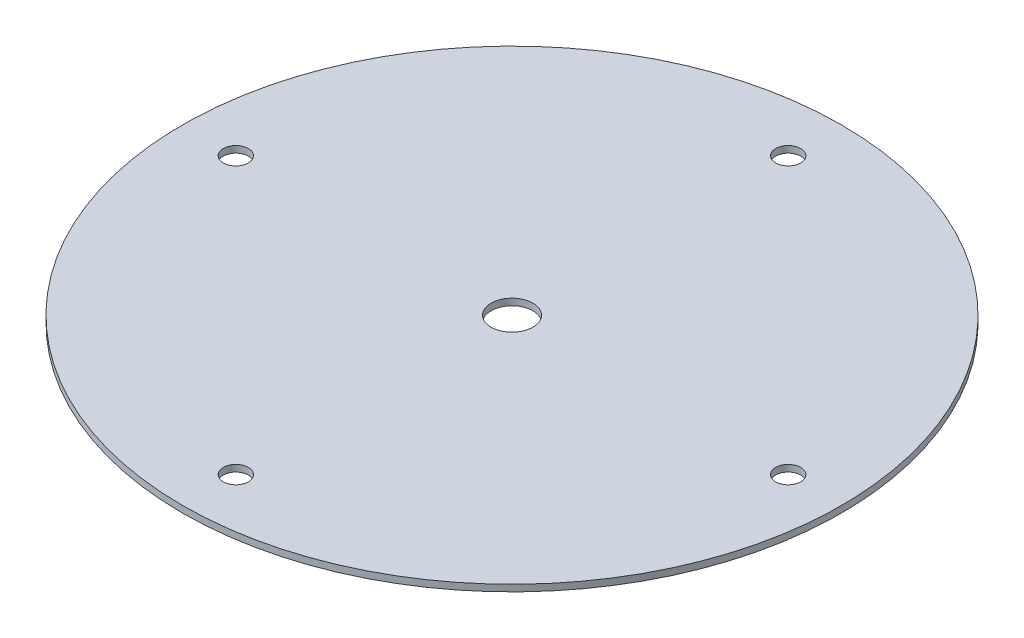
ISO-10303-21;
HEADER;
FILE_DESCRIPTION(('STEP AP214'),'2;1');
FILE_NAME('part.step','',(''),(''),'','','');
FILE_SCHEMA(('AUTOMOTIVE_DESIGN { 1 0 10303 214 1 1 1 1 }'));
ENDSEC;
DATA;
#1=APPLICATION_CONTEXT('core data for automotive mechanical design processes');
#2=APPLICATION_PROTOCOL_DEFINITION('international standard','automotive_design',2000,#1);
#3=PRODUCT_CONTEXT('',#1,'mechanical');
#4=PRODUCT('Part','Part','',(#3));
#5=PRODUCT_RELATED_PRODUCT_CATEGORY('part','',(#4));
#6=PRODUCT_DEFINITION_FORMATION('','',#4);
#7=PRODUCT_DEFINITION_CONTEXT('part definition',#1,'design');
#8=PRODUCT_DEFINITION('design','',#6,#7);
#9=PRODUCT_DEFINITION_SHAPE('','',#8);
#10=(LENGTH_UNIT() NAMED_UNIT(*) SI_UNIT(.MILLI.,.METRE.));
#11=(NAMED_UNIT(*) PLANE_ANGLE_UNIT() SI_UNIT($,.RADIAN.));
#12=(NAMED_UNIT(*) SI_UNIT($,.STERADIAN.) SOLID_ANGLE_UNIT());
#13=UNCERTAINTY_MEASURE_WITH_UNIT(LENGTH_MEASURE(1.E-05),#10,'distance_accuracy_value','');
#14=(GEOMETRIC_REPRESENTATION_CONTEXT(3) GLOBAL_UNCERTAINTY_ASSIGNED_CONTEXT((#13)) GLOBAL_UNIT_ASSIGNED_CONTEXT((#10,
#11,#12)) REPRESENTATION_CONTEXT('',''));
#15=CARTESIAN_POINT('',(0.,0.,0.));
#16=DIRECTION('',(0.,0.,1.));
#17=DIRECTION('',(1.,0.,0.));
#18=AXIS2_PLACEMENT_3D('',#15,#16,#17);
#19=CARTESIAN_POINT('',(0.,1.5875,0.));
#20=DIRECTION('',(0.,1.,0.));
#21=DIRECTION('',(0.,0.,1.));
#22=AXIS2_PLACEMENT_3D('',#19,#20,#21);
#23=PLANE('',#22);
#24=CARTESIAN_POINT('',(1.86530284067203E-12,1.5875,66.2));
#25=DIRECTION('',(0.,1.,0.));
#26=DIRECTION('',(0.,0.,1.));
#27=AXIS2_PLACEMENT_3D('',#24,#25,#26);
#28=CIRCLE('',#27,3.00000000000223);
#29=CARTESIAN_POINT('',(1.86530284067203E-12,1.5875,69.2000000000022));
#30=VERTEX_POINT('',#29);
#31=EDGE_CURVE('E59',#30,#30,#28,.T.);
#32=ORIENTED_EDGE('',*,*,#31,.F.);
#33=EDGE_LOOP('',(#32));
#34=FACE_BOUND('',#33,.T.);
#35=CARTESIAN_POINT('',(0.,1.5875,0.));
#36=DIRECTION('',(0.,1.,0.));
#37=DIRECTION('',(0.,0.,1.));
#38=AXIS2_PLACEMENT_3D('',#35,#36,#37);
#39=CIRCLE('',#38,5.);
#40=CARTESIAN_POINT('',(0.,1.5875,5.));
#41=VERTEX_POINT('',#40);
#42=EDGE_CURVE('E47',#41,#41,#39,.T.);
#43=ORIENTED_EDGE('',*,*,#42,.F.);
#44=EDGE_LOOP('',(#43));
#45=FACE_BOUND('',#44,.T.);
#46=CARTESIAN_POINT('',(0.,1.5875,0.));
#47=DIRECTION('',(0.,1.,0.));
#48=DIRECTION('',(0.,0.,1.));
#49=AXIS2_PLACEMENT_3D('',#46,#47,#48);
#50=CIRCLE('',#49,79.);
#51=CARTESIAN_POINT('',(0.,1.5875,79.));
#52=VERTEX_POINT('',#51);
#53=EDGE_CURVE('E10',#52,#52,#50,.T.);
#54=ORIENTED_EDGE('',*,*,#53,.T.);
#55=EDGE_LOOP('',(#54));
#56=FACE_BOUND('',#55,.T.);
#57=CARTESIAN_POINT('',(0.,1.5875,-66.2));
#58=DIRECTION('',(0.,1.,0.));
#59=DIRECTION('',(0.,0.,1.));
#60=AXIS2_PLACEMENT_3D('',#57,#58,#59);
#61=CIRCLE('',#60,3.);
#62=CARTESIAN_POINT('',(0.,1.5875,-63.2));
#63=VERTEX_POINT('',#62);
#64=EDGE_CURVE('E42',#63,#63,#61,.T.);
#65=ORIENTED_EDGE('',*,*,#64,.F.);
#66=EDGE_LOOP('',(#65));
#67=FACE_BOUND('',#66,.T.);
#68=CARTESIAN_POINT('',(66.2,1.5875,2.31136064631415E-13));
#69=DIRECTION('',(0.,1.,0.));
#70=DIRECTION('',(0.,0.,1.));
#71=AXIS2_PLACEMENT_3D('',#68,#69,#70);
#72=CIRCLE('',#71,3.);
#73=CARTESIAN_POINT('',(66.2,1.5875,3.00000000000023));
#74=VERTEX_POINT('',#73);
#75=EDGE_CURVE('E53',#74,#74,#72,.T.);
#76=ORIENTED_EDGE('',*,*,#75,.F.);
#77=EDGE_LOOP('',(#76));
#78=FACE_BOUND('',#77,.T.);
#79=CARTESIAN_POINT('',(-66.1999999999991,1.5875,9.40758582146373E-13));
#80=DIRECTION('',(0.,1.,0.));
#81=DIRECTION('',(0.,0.,1.));
#82=AXIS2_PLACEMENT_3D('',#79,#80,#81);
#83=CIRCLE('',#82,3.00000000000184);
#84=CARTESIAN_POINT('',(-66.1999999999991,1.5875,3.00000000000278));
#85=VERTEX_POINT('',#84);
#86=EDGE_CURVE('E65',#85,#85,#83,.T.);
#87=ORIENTED_EDGE('',*,*,#86,.F.);
#88=EDGE_LOOP('',(#87));
#89=FACE_BOUND('',#88,.T.);
#90=ADVANCED_FACE('F31',(#34,#45,#56,#67,#78,#89),#23,.T.);
#91=CARTESIAN_POINT('',(0.,0.,0.));
#92=DIRECTION('',(0.,1.,0.));
#93=DIRECTION('',(0.,0.,1.));
#94=AXIS2_PLACEMENT_3D('',#91,#92,#93);
#95=PLANE('',#94);
#96=CARTESIAN_POINT('',(0.,0.,0.));
#97=DIRECTION('',(0.,1.,0.));
#98=DIRECTION('',(0.,0.,1.));
#99=AXIS2_PLACEMENT_3D('',#96,#97,#98);
#100=CIRCLE('',#99,79.);
#101=CARTESIAN_POINT('',(0.,0.,79.));
#102=VERTEX_POINT('',#101);
#103=EDGE_CURVE('E35',#102,#102,#100,.T.);
#104=ORIENTED_EDGE('',*,*,#103,.F.);
#105=EDGE_LOOP('',(#104));
#106=FACE_BOUND('',#105,.T.);
#107=CARTESIAN_POINT('',(0.,0.,-66.2));
#108=DIRECTION('',(0.,1.,0.));
#109=DIRECTION('',(0.,0.,1.));
#110=AXIS2_PLACEMENT_3D('',#107,#108,#109);
#111=CIRCLE('',#110,3.);
#112=CARTESIAN_POINT('',(0.,0.,-63.2));
#113=VERTEX_POINT('',#112);
#114=EDGE_CURVE('E44',#113,#113,#111,.T.);
#115=ORIENTED_EDGE('',*,*,#114,.T.);
#116=EDGE_LOOP('',(#115));
#117=FACE_BOUND('',#116,.T.);
#118=CARTESIAN_POINT('',(0.,0.,0.));
#119=DIRECTION('',(0.,1.,0.));
#120=DIRECTION('',(0.,0.,1.));
#121=AXIS2_PLACEMENT_3D('',#118,#119,#120);
#122=CIRCLE('',#121,5.);
#123=CARTESIAN_POINT('',(0.,0.,5.));
#124=VERTEX_POINT('',#123);
#125=EDGE_CURVE('E50',#124,#124,#122,.T.);
#126=ORIENTED_EDGE('',*,*,#125,.T.);
#127=EDGE_LOOP('',(#126));
#128=FACE_BOUND('',#127,.T.);
#129=CARTESIAN_POINT('',(66.2,0.,2.31136064631415E-13));
#130=DIRECTION('',(0.,1.,0.));
#131=DIRECTION('',(0.,0.,1.));
#132=AXIS2_PLACEMENT_3D('',#129,#130,#131);
#133=CIRCLE('',#132,3.);
#134=CARTESIAN_POINT('',(66.2,0.,3.00000000000023));
#135=VERTEX_POINT('',#134);
#136=EDGE_CURVE('E56',#135,#135,#133,.T.);
#137=ORIENTED_EDGE('',*,*,#136,.T.);
#138=EDGE_LOOP('',(#137));
#139=FACE_BOUND('',#138,.T.);
#140=CARTESIAN_POINT('',(1.86530284067203E-12,0.,66.2));
#141=DIRECTION('',(0.,1.,0.));
#142=DIRECTION('',(0.,0.,1.));
#143=AXIS2_PLACEMENT_3D('',#140,#141,#142);
#144=CIRCLE('',#143,3.00000000000223);
#145=CARTESIAN_POINT('',(1.86530284067203E-12,0.,69.2000000000022));
#146=VERTEX_POINT('',#145);
#147=EDGE_CURVE('E62',#146,#146,#144,.T.);
#148=ORIENTED_EDGE('',*,*,#147,.T.);
#149=EDGE_LOOP('',(#148));
#150=FACE_BOUND('',#149,.T.);
#151=CARTESIAN_POINT('',(-66.1999999999991,0.,9.40758582146373E-13));
#152=DIRECTION('',(0.,1.,0.));
#153=DIRECTION('',(0.,0.,1.));
#154=AXIS2_PLACEMENT_3D('',#151,#152,#153);
#155=CIRCLE('',#154,3.00000000000184);
#156=CARTESIAN_POINT('',(-66.1999999999991,0.,3.00000000000278));
#157=VERTEX_POINT('',#156);
#158=EDGE_CURVE('E68',#157,#157,#155,.T.);
#159=ORIENTED_EDGE('',*,*,#158,.T.);
#160=EDGE_LOOP('',(#159));
#161=FACE_BOUND('',#160,.T.);
#162=ADVANCED_FACE('F78',(#106,#117,#128,#139,#150,#161),#95,.F.);
#163=CARTESIAN_POINT('',(0.,1.5875,0.));
#164=DIRECTION('',(0.,-1.,0.));
#165=DIRECTION('',(0.,0.,-1.));
#166=AXIS2_PLACEMENT_3D('',#163,#164,#165);
#167=CYLINDRICAL_SURFACE('',#166,79.);
#168=ORIENTED_EDGE('',*,*,#53,.F.);
#169=EDGE_LOOP('',(#168));
#170=FACE_BOUND('',#169,.T.);
#171=ORIENTED_EDGE('',*,*,#103,.T.);
#172=EDGE_LOOP('',(#171));
#173=FACE_BOUND('',#172,.T.);
#174=ADVANCED_FACE('F33',(#170,#173),#167,.T.);
#175=CARTESIAN_POINT('',(0.,1.5875,-66.2));
#176=DIRECTION('',(0.,-1.,0.));
#177=DIRECTION('',(0.,0.,-1.));
#178=AXIS2_PLACEMENT_3D('',#175,#176,#177);
#179=CYLINDRICAL_SURFACE('',#178,3.);
#180=ORIENTED_EDGE('',*,*,#64,.T.);
#181=EDGE_LOOP('',(#180));
#182=FACE_BOUND('',#181,.T.);
#183=ORIENTED_EDGE('',*,*,#114,.F.);
#184=EDGE_LOOP('',(#183));
#185=FACE_BOUND('',#184,.T.);
#186=ADVANCED_FACE('F88',(#182,#185),#179,.F.);
#187=CARTESIAN_POINT('',(0.,1.5875,0.));
#188=DIRECTION('',(0.,-1.,0.));
#189=DIRECTION('',(0.,0.,-1.));
#190=AXIS2_PLACEMENT_3D('',#187,#188,#189);
#191=CYLINDRICAL_SURFACE('',#190,5.);
#192=ORIENTED_EDGE('',*,*,#42,.T.);
#193=EDGE_LOOP('',(#192));
#194=FACE_BOUND('',#193,.T.);
#195=ORIENTED_EDGE('',*,*,#125,.F.);
#196=EDGE_LOOP('',(#195));
#197=FACE_BOUND('',#196,.T.);
#198=ADVANCED_FACE('F91',(#194,#197),#191,.F.);
#199=CARTESIAN_POINT('',(66.2,1.5875,2.31136064631415E-13));
#200=DIRECTION('',(0.,-1.,0.));
#201=DIRECTION('',(0.,0.,-1.));
#202=AXIS2_PLACEMENT_3D('',#199,#200,#201);
#203=CYLINDRICAL_SURFACE('',#202,3.);
#204=ORIENTED_EDGE('',*,*,#75,.T.);
#205=EDGE_LOOP('',(#204));
#206=FACE_BOUND('',#205,.T.);
#207=ORIENTED_EDGE('',*,*,#136,.F.);
#208=EDGE_LOOP('',(#207));
#209=FACE_BOUND('',#208,.T.);
#210=ADVANCED_FACE('F95',(#206,#209),#203,.F.);
#211=CARTESIAN_POINT('',(1.86530284067203E-12,1.5875,66.2));
#212=DIRECTION('',(0.,-1.,0.));
#213=DIRECTION('',(0.,0.,-1.));
#214=AXIS2_PLACEMENT_3D('',#211,#212,#213);
#215=CYLINDRICAL_SURFACE('',#214,3.00000000000223);
#216=ORIENTED_EDGE('',*,*,#31,.T.);
#217=EDGE_LOOP('',(#216));
#218=FACE_BOUND('',#217,.T.);
#219=ORIENTED_EDGE('',*,*,#147,.F.);
#220=EDGE_LOOP('',(#219));
#221=FACE_BOUND('',#220,.T.);
#222=ADVANCED_FACE('F99',(#218,#221),#215,.F.);
#223=CARTESIAN_POINT('',(-66.1999999999991,1.5875,9.40758582146373E-13));
#224=DIRECTION('',(0.,-1.,0.));
#225=DIRECTION('',(0.,0.,-1.));
#226=AXIS2_PLACEMENT_3D('',#223,#224,#225);
#227=CYLINDRICAL_SURFACE('',#226,3.00000000000184);
#228=ORIENTED_EDGE('',*,*,#86,.T.);
#229=EDGE_LOOP('',(#228));
#230=FACE_BOUND('',#229,.T.);
#231=ORIENTED_EDGE('',*,*,#158,.F.);
#232=EDGE_LOOP('',(#231));
#233=FACE_BOUND('',#232,.T.);
#234=ADVANCED_FACE('F74',(#230,#233),#227,.F.);
#235=CLOSED_SHELL('',(#90,#162,#174,#186,#198,#210,#222,#234));
#236=MANIFOLD_SOLID_BREP('B2',#235);
#237=ADVANCED_BREP_SHAPE_REPRESENTATION('',(#18,#236),#14);
#238=SHAPE_DEFINITION_REPRESENTATION(#9,#237);
ENDSEC;
END-ISO-10303-21;
